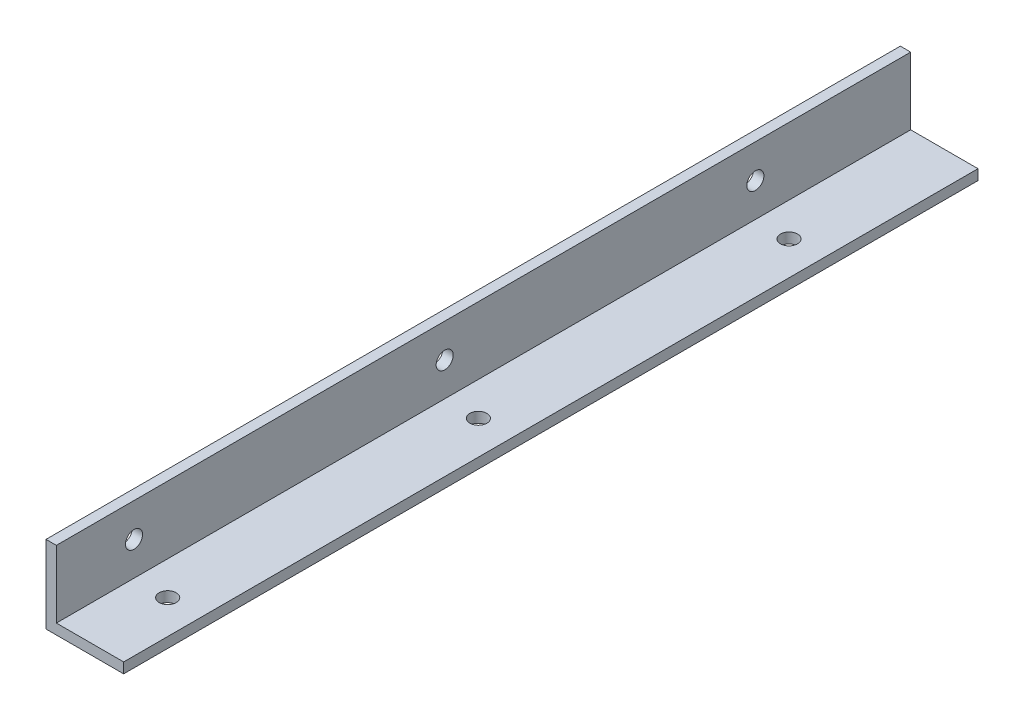
ISO-10303-21;
HEADER;
FILE_DESCRIPTION(('STEP AP214'),'2;1');
FILE_NAME('part.step','',(''),(''),'','','');
FILE_SCHEMA(('AUTOMOTIVE_DESIGN { 1 0 10303 214 1 1 1 1 }'));
ENDSEC;
DATA;
#1=APPLICATION_CONTEXT('core data for automotive mechanical design processes');
#2=APPLICATION_PROTOCOL_DEFINITION('international standard','automotive_design',2000,#1);
#3=PRODUCT_CONTEXT('',#1,'mechanical');
#4=PRODUCT('Part','Part','',(#3));
#5=PRODUCT_RELATED_PRODUCT_CATEGORY('part','',(#4));
#6=PRODUCT_DEFINITION_FORMATION('','',#4);
#7=PRODUCT_DEFINITION_CONTEXT('part definition',#1,'design');
#8=PRODUCT_DEFINITION('design','',#6,#7);
#9=PRODUCT_DEFINITION_SHAPE('','',#8);
#10=(LENGTH_UNIT() NAMED_UNIT(*) SI_UNIT(.MILLI.,.METRE.));
#11=(NAMED_UNIT(*) PLANE_ANGLE_UNIT() SI_UNIT($,.RADIAN.));
#12=(NAMED_UNIT(*) SI_UNIT($,.STERADIAN.) SOLID_ANGLE_UNIT());
#13=UNCERTAINTY_MEASURE_WITH_UNIT(LENGTH_MEASURE(1.E-05),#10,'distance_accuracy_value','');
#14=(GEOMETRIC_REPRESENTATION_CONTEXT(3) GLOBAL_UNCERTAINTY_ASSIGNED_CONTEXT((#13)) GLOBAL_UNIT_ASSIGNED_CONTEXT((#10,
#11,#12)) REPRESENTATION_CONTEXT('',''));
#15=CARTESIAN_POINT('',(0.,0.,0.));
#16=DIRECTION('',(0.,0.,1.));
#17=DIRECTION('',(1.,0.,0.));
#18=AXIS2_PLACEMENT_3D('',#15,#16,#17);
#19=CARTESIAN_POINT('',(15.,0.,150.));
#20=DIRECTION('',(0.,1.,0.));
#21=DIRECTION('',(-1.,0.,0.));
#22=AXIS2_PLACEMENT_3D('',#19,#20,#21);
#23=PLANE('',#22);
#24=CARTESIAN_POINT('',(8.50000000000002,0.,15.));
#25=DIRECTION('',(0.,1.,0.));
#26=DIRECTION('',(-1.,0.,0.));
#27=AXIS2_PLACEMENT_3D('',#24,#25,#26);
#28=CIRCLE('',#27,1.64999999999999);
#29=CARTESIAN_POINT('',(6.85000000000003,0.,15.));
#30=VERTEX_POINT('',#29);
#31=EDGE_CURVE('E38',#30,#30,#28,.T.);
#32=ORIENTED_EDGE('',*,*,#31,.T.);
#33=EDGE_LOOP('',(#32));
#34=FACE_BOUND('',#33,.T.);
#35=CARTESIAN_POINT('',(8.50000000000002,0.,75.));
#36=DIRECTION('',(0.,1.,0.));
#37=DIRECTION('',(-1.,0.,0.));
#38=AXIS2_PLACEMENT_3D('',#35,#36,#37);
#39=CIRCLE('',#38,1.64999999999999);
#40=CARTESIAN_POINT('',(6.85000000000003,0.,75.));
#41=VERTEX_POINT('',#40);
#42=EDGE_CURVE('E204',#41,#41,#39,.T.);
#43=ORIENTED_EDGE('',*,*,#42,.T.);
#44=EDGE_LOOP('',(#43));
#45=FACE_BOUND('',#44,.T.);
#46=CARTESIAN_POINT('',(8.50000000000002,0.,135.));
#47=DIRECTION('',(0.,1.,0.));
#48=DIRECTION('',(-1.,0.,0.));
#49=AXIS2_PLACEMENT_3D('',#46,#47,#48);
#50=CIRCLE('',#49,1.64999999999999);
#51=CARTESIAN_POINT('',(6.85000000000003,0.,135.));
#52=VERTEX_POINT('',#51);
#53=EDGE_CURVE('E150',#52,#52,#50,.T.);
#54=ORIENTED_EDGE('',*,*,#53,.T.);
#55=EDGE_LOOP('',(#54));
#56=FACE_BOUND('',#55,.T.);
#57=DIRECTION('',(0.,0.,-1.));
#58=VECTOR('',#57,1.);
#59=CARTESIAN_POINT('',(0.,0.,150.));
#60=LINE('',#59,#58);
#61=CARTESIAN_POINT('',(0.,0.,150.));
#62=VERTEX_POINT('',#61);
#63=CARTESIAN_POINT('',(0.,0.,-15.));
#64=VERTEX_POINT('',#63);
#65=EDGE_CURVE('E98',#62,#64,#60,.T.);
#66=ORIENTED_EDGE('',*,*,#65,.T.);
#67=DIRECTION('',(-1.,0.,0.));
#68=VECTOR('',#67,1.);
#69=CARTESIAN_POINT('',(0.,0.,-15.));
#70=LINE('',#69,#68);
#71=CARTESIAN_POINT('',(15.,0.,-15.));
#72=VERTEX_POINT('',#71);
#73=EDGE_CURVE('E97',#72,#64,#70,.T.);
#74=ORIENTED_EDGE('',*,*,#73,.F.);
#75=DIRECTION('',(0.,0.,-1.));
#76=VECTOR('',#75,1.);
#77=CARTESIAN_POINT('',(15.,0.,150.));
#78=LINE('',#77,#76);
#79=CARTESIAN_POINT('',(15.,0.,150.));
#80=VERTEX_POINT('',#79);
#81=EDGE_CURVE('E11',#80,#72,#78,.T.);
#82=ORIENTED_EDGE('',*,*,#81,.F.);
#83=DIRECTION('',(1.,0.,0.));
#84=VECTOR('',#83,1.);
#85=CARTESIAN_POINT('',(15.,0.,150.));
#86=LINE('',#85,#84);
#87=EDGE_CURVE('E124',#62,#80,#86,.T.);
#88=ORIENTED_EDGE('',*,*,#87,.F.);
#89=EDGE_LOOP('',(#66,#74,#82,#88));
#90=FACE_BOUND('',#89,.T.);
#91=ADVANCED_FACE('F35',(#34,#45,#56,#90),#23,.F.);
#92=CARTESIAN_POINT('',(15.,2.,150.));
#93=DIRECTION('',(-1.,0.,0.));
#94=DIRECTION('',(0.,0.,1.));
#95=AXIS2_PLACEMENT_3D('',#92,#93,#94);
#96=PLANE('',#95);
#97=ORIENTED_EDGE('',*,*,#81,.T.);
#98=DIRECTION('',(0.,-1.,0.));
#99=VECTOR('',#98,1.);
#100=CARTESIAN_POINT('',(15.,0.,-15.));
#101=LINE('',#100,#99);
#102=CARTESIAN_POINT('',(15.,2.,-15.));
#103=VERTEX_POINT('',#102);
#104=EDGE_CURVE('E92',#103,#72,#101,.T.);
#105=ORIENTED_EDGE('',*,*,#104,.F.);
#106=DIRECTION('',(0.,0.,-1.));
#107=VECTOR('',#106,1.);
#108=CARTESIAN_POINT('',(15.,2.,150.));
#109=LINE('',#108,#107);
#110=CARTESIAN_POINT('',(15.,2.,150.));
#111=VERTEX_POINT('',#110);
#112=EDGE_CURVE('E43',#111,#103,#109,.T.);
#113=ORIENTED_EDGE('',*,*,#112,.F.);
#114=DIRECTION('',(0.,1.,0.));
#115=VECTOR('',#114,1.);
#116=CARTESIAN_POINT('',(15.,2.,150.));
#117=LINE('',#116,#115);
#118=EDGE_CURVE('E93',#80,#111,#117,.T.);
#119=ORIENTED_EDGE('',*,*,#118,.F.);
#120=EDGE_LOOP('',(#97,#105,#113,#119));
#121=FACE_BOUND('',#120,.T.);
#122=ADVANCED_FACE('F89',(#121),#96,.F.);
#123=CARTESIAN_POINT('',(2.,2.,150.));
#124=DIRECTION('',(0.,-1.,0.));
#125=DIRECTION('',(0.,0.,-1.));
#126=AXIS2_PLACEMENT_3D('',#123,#124,#125);
#127=PLANE('',#126);
#128=CARTESIAN_POINT('',(8.50000000000002,2.,15.));
#129=DIRECTION('',(0.,1.,0.));
#130=DIRECTION('',(0.,0.,1.));
#131=AXIS2_PLACEMENT_3D('',#128,#129,#130);
#132=CIRCLE('',#131,1.64999999999999);
#133=CARTESIAN_POINT('',(8.50000000000002,2.,16.65));
#134=VERTEX_POINT('',#133);
#135=EDGE_CURVE('E347',#134,#134,#132,.T.);
#136=ORIENTED_EDGE('',*,*,#135,.F.);
#137=EDGE_LOOP('',(#136));
#138=FACE_BOUND('',#137,.T.);
#139=CARTESIAN_POINT('',(8.50000000000002,2.,75.));
#140=DIRECTION('',(0.,1.,0.));
#141=DIRECTION('',(0.,0.,1.));
#142=AXIS2_PLACEMENT_3D('',#139,#140,#141);
#143=CIRCLE('',#142,1.64999999999999);
#144=CARTESIAN_POINT('',(8.50000000000002,2.,76.65));
#145=VERTEX_POINT('',#144);
#146=EDGE_CURVE('E351',#145,#145,#143,.T.);
#147=ORIENTED_EDGE('',*,*,#146,.F.);
#148=EDGE_LOOP('',(#147));
#149=FACE_BOUND('',#148,.T.);
#150=CARTESIAN_POINT('',(8.50000000000002,2.,135.));
#151=DIRECTION('',(0.,1.,0.));
#152=DIRECTION('',(0.,0.,1.));
#153=AXIS2_PLACEMENT_3D('',#150,#151,#152);
#154=CIRCLE('',#153,1.64999999999999);
#155=CARTESIAN_POINT('',(8.50000000000002,2.,136.65));
#156=VERTEX_POINT('',#155);
#157=EDGE_CURVE('E155',#156,#156,#154,.T.);
#158=ORIENTED_EDGE('',*,*,#157,.F.);
#159=EDGE_LOOP('',(#158));
#160=FACE_BOUND('',#159,.T.);
#161=ORIENTED_EDGE('',*,*,#112,.T.);
#162=DIRECTION('',(1.,0.,0.));
#163=VECTOR('',#162,1.);
#164=CARTESIAN_POINT('',(15.,2.,-15.));
#165=LINE('',#164,#163);
#166=CARTESIAN_POINT('',(2.,2.,-15.));
#167=VERTEX_POINT('',#166);
#168=EDGE_CURVE('E108',#167,#103,#165,.T.);
#169=ORIENTED_EDGE('',*,*,#168,.F.);
#170=DIRECTION('',(0.,0.,-1.));
#171=VECTOR('',#170,1.);
#172=CARTESIAN_POINT('',(2.,2.,150.));
#173=LINE('',#172,#171);
#174=CARTESIAN_POINT('',(2.,2.,150.));
#175=VERTEX_POINT('',#174);
#176=EDGE_CURVE('E138',#175,#167,#173,.T.);
#177=ORIENTED_EDGE('',*,*,#176,.F.);
#178=DIRECTION('',(-1.,0.,0.));
#179=VECTOR('',#178,1.);
#180=CARTESIAN_POINT('',(2.,2.,150.));
#181=LINE('',#180,#179);
#182=EDGE_CURVE('E127',#111,#175,#181,.T.);
#183=ORIENTED_EDGE('',*,*,#182,.F.);
#184=EDGE_LOOP('',(#161,#169,#177,#183));
#185=FACE_BOUND('',#184,.T.);
#186=ADVANCED_FACE('F171',(#138,#149,#160,#185),#127,.F.);
#187=CARTESIAN_POINT('',(2.,15.,150.));
#188=DIRECTION('',(-1.,0.,0.));
#189=DIRECTION('',(0.,-1.,0.));
#190=AXIS2_PLACEMENT_3D('',#187,#188,#189);
#191=PLANE('',#190);
#192=CARTESIAN_POINT('',(2.,8.49999999999998,135.));
#193=DIRECTION('',(1.,0.,0.));
#194=DIRECTION('',(0.,0.,-1.));
#195=AXIS2_PLACEMENT_3D('',#192,#193,#194);
#196=CIRCLE('',#195,1.64999999999999);
#197=CARTESIAN_POINT('',(2.,8.49999999999998,133.35));
#198=VERTEX_POINT('',#197);
#199=EDGE_CURVE('E143',#198,#198,#196,.T.);
#200=ORIENTED_EDGE('',*,*,#199,.F.);
#201=EDGE_LOOP('',(#200));
#202=FACE_BOUND('',#201,.T.);
#203=CARTESIAN_POINT('',(2.,8.49999999999998,75.));
#204=DIRECTION('',(1.,0.,0.));
#205=DIRECTION('',(0.,0.,-1.));
#206=AXIS2_PLACEMENT_3D('',#203,#204,#205);
#207=CIRCLE('',#206,1.64999999999999);
#208=CARTESIAN_POINT('',(2.,8.49999999999998,73.35));
#209=VERTEX_POINT('',#208);
#210=EDGE_CURVE('E142',#209,#209,#207,.T.);
#211=ORIENTED_EDGE('',*,*,#210,.F.);
#212=EDGE_LOOP('',(#211));
#213=FACE_BOUND('',#212,.T.);
#214=CARTESIAN_POINT('',(2.,8.49999999999998,15.));
#215=DIRECTION('',(1.,0.,0.));
#216=DIRECTION('',(0.,0.,-1.));
#217=AXIS2_PLACEMENT_3D('',#214,#215,#216);
#218=CIRCLE('',#217,1.64999999999999);
#219=CARTESIAN_POINT('',(2.,8.49999999999998,13.35));
#220=VERTEX_POINT('',#219);
#221=EDGE_CURVE('E112',#220,#220,#218,.T.);
#222=ORIENTED_EDGE('',*,*,#221,.F.);
#223=EDGE_LOOP('',(#222));
#224=FACE_BOUND('',#223,.T.);
#225=ORIENTED_EDGE('',*,*,#176,.T.);
#226=DIRECTION('',(0.,-1.,0.));
#227=VECTOR('',#226,1.);
#228=CARTESIAN_POINT('',(2.,2.,-15.));
#229=LINE('',#228,#227);
#230=CARTESIAN_POINT('',(2.,15.,-15.));
#231=VERTEX_POINT('',#230);
#232=EDGE_CURVE('E121',#231,#167,#229,.T.);
#233=ORIENTED_EDGE('',*,*,#232,.F.);
#234=DIRECTION('',(0.,0.,-1.));
#235=VECTOR('',#234,1.);
#236=CARTESIAN_POINT('',(2.,15.,150.));
#237=LINE('',#236,#235);
#238=CARTESIAN_POINT('',(2.,15.,150.));
#239=VERTEX_POINT('',#238);
#240=EDGE_CURVE('E136',#239,#231,#237,.T.);
#241=ORIENTED_EDGE('',*,*,#240,.F.);
#242=DIRECTION('',(0.,1.,0.));
#243=VECTOR('',#242,1.);
#244=CARTESIAN_POINT('',(2.,15.,150.));
#245=LINE('',#244,#243);
#246=EDGE_CURVE('E129',#175,#239,#245,.T.);
#247=ORIENTED_EDGE('',*,*,#246,.F.);
#248=EDGE_LOOP('',(#225,#233,#241,#247));
#249=FACE_BOUND('',#248,.T.);
#250=ADVANCED_FACE('F167',(#202,#213,#224,#249),#191,.F.);
#251=CARTESIAN_POINT('',(0.,15.,150.));
#252=DIRECTION('',(0.,-1.,0.));
#253=DIRECTION('',(0.,0.,-1.));
#254=AXIS2_PLACEMENT_3D('',#251,#252,#253);
#255=PLANE('',#254);
#256=ORIENTED_EDGE('',*,*,#240,.T.);
#257=DIRECTION('',(1.,0.,0.));
#258=VECTOR('',#257,1.);
#259=CARTESIAN_POINT('',(2.,15.,-15.));
#260=LINE('',#259,#258);
#261=CARTESIAN_POINT('',(0.,15.,-15.));
#262=VERTEX_POINT('',#261);
#263=EDGE_CURVE('E118',#262,#231,#260,.T.);
#264=ORIENTED_EDGE('',*,*,#263,.F.);
#265=DIRECTION('',(0.,0.,-1.));
#266=VECTOR('',#265,1.);
#267=CARTESIAN_POINT('',(0.,15.,150.));
#268=LINE('',#267,#266);
#269=CARTESIAN_POINT('',(0.,15.,150.));
#270=VERTEX_POINT('',#269);
#271=EDGE_CURVE('E134',#270,#262,#268,.T.);
#272=ORIENTED_EDGE('',*,*,#271,.F.);
#273=DIRECTION('',(-1.,0.,0.));
#274=VECTOR('',#273,1.);
#275=CARTESIAN_POINT('',(0.,15.,150.));
#276=LINE('',#275,#274);
#277=EDGE_CURVE('E56',#239,#270,#276,.T.);
#278=ORIENTED_EDGE('',*,*,#277,.F.);
#279=EDGE_LOOP('',(#256,#264,#272,#278));
#280=FACE_BOUND('',#279,.T.);
#281=ADVANCED_FACE('F170',(#280),#255,.F.);
#282=CARTESIAN_POINT('',(0.,0.,150.));
#283=DIRECTION('',(1.,0.,0.));
#284=DIRECTION('',(0.,0.,-1.));
#285=AXIS2_PLACEMENT_3D('',#282,#283,#284);
#286=PLANE('',#285);
#287=CARTESIAN_POINT('',(0.,8.49999999999998,135.));
#288=DIRECTION('',(1.,0.,0.));
#289=DIRECTION('',(0.,0.,-1.));
#290=AXIS2_PLACEMENT_3D('',#287,#288,#289);
#291=CIRCLE('',#290,1.64999999999999);
#292=CARTESIAN_POINT('',(0.,8.49999999999998,133.35));
#293=VERTEX_POINT('',#292);
#294=EDGE_CURVE('E140',#293,#293,#291,.T.);
#295=ORIENTED_EDGE('',*,*,#294,.T.);
#296=EDGE_LOOP('',(#295));
#297=FACE_BOUND('',#296,.T.);
#298=CARTESIAN_POINT('',(0.,8.49999999999998,75.));
#299=DIRECTION('',(1.,0.,0.));
#300=DIRECTION('',(0.,0.,-1.));
#301=AXIS2_PLACEMENT_3D('',#298,#299,#300);
#302=CIRCLE('',#301,1.64999999999999);
#303=CARTESIAN_POINT('',(0.,8.49999999999998,73.35));
#304=VERTEX_POINT('',#303);
#305=EDGE_CURVE('E147',#304,#304,#302,.T.);
#306=ORIENTED_EDGE('',*,*,#305,.T.);
#307=EDGE_LOOP('',(#306));
#308=FACE_BOUND('',#307,.T.);
#309=CARTESIAN_POINT('',(0.,8.49999999999998,15.));
#310=DIRECTION('',(1.,0.,0.));
#311=DIRECTION('',(0.,0.,-1.));
#312=AXIS2_PLACEMENT_3D('',#309,#310,#311);
#313=CIRCLE('',#312,1.64999999999999);
#314=CARTESIAN_POINT('',(0.,8.49999999999998,13.35));
#315=VERTEX_POINT('',#314);
#316=EDGE_CURVE('E109',#315,#315,#313,.T.);
#317=ORIENTED_EDGE('',*,*,#316,.T.);
#318=EDGE_LOOP('',(#317));
#319=FACE_BOUND('',#318,.T.);
#320=ORIENTED_EDGE('',*,*,#271,.T.);
#321=DIRECTION('',(0.,1.,0.));
#322=VECTOR('',#321,1.);
#323=CARTESIAN_POINT('',(0.,15.,-15.));
#324=LINE('',#323,#322);
#325=EDGE_CURVE('E102',#64,#262,#324,.T.);
#326=ORIENTED_EDGE('',*,*,#325,.F.);
#327=ORIENTED_EDGE('',*,*,#65,.F.);
#328=DIRECTION('',(0.,-1.,0.));
#329=VECTOR('',#328,1.);
#330=CARTESIAN_POINT('',(0.,0.,150.));
#331=LINE('',#330,#329);
#332=EDGE_CURVE('E51',#270,#62,#331,.T.);
#333=ORIENTED_EDGE('',*,*,#332,.F.);
#334=EDGE_LOOP('',(#320,#326,#327,#333));
#335=FACE_BOUND('',#334,.T.);
#336=ADVANCED_FACE('F184',(#297,#308,#319,#335),#286,.F.);
#337=CARTESIAN_POINT('',(0.,0.,150.));
#338=DIRECTION('',(0.,0.,-1.));
#339=DIRECTION('',(-1.,0.,0.));
#340=AXIS2_PLACEMENT_3D('',#337,#338,#339);
#341=PLANE('',#340);
#342=ORIENTED_EDGE('',*,*,#87,.T.);
#343=ORIENTED_EDGE('',*,*,#118,.T.);
#344=ORIENTED_EDGE('',*,*,#182,.T.);
#345=ORIENTED_EDGE('',*,*,#246,.T.);
#346=ORIENTED_EDGE('',*,*,#277,.T.);
#347=ORIENTED_EDGE('',*,*,#332,.T.);
#348=EDGE_LOOP('',(#342,#343,#344,#345,#346,#347));
#349=FACE_BOUND('',#348,.T.);
#350=ADVANCED_FACE('F181',(#349),#341,.F.);
#351=CARTESIAN_POINT('',(0.,0.,-15.));
#352=DIRECTION('',(0.,0.,1.));
#353=DIRECTION('',(1.,0.,0.));
#354=AXIS2_PLACEMENT_3D('',#351,#352,#353);
#355=PLANE('',#354);
#356=ORIENTED_EDGE('',*,*,#104,.T.);
#357=ORIENTED_EDGE('',*,*,#73,.T.);
#358=ORIENTED_EDGE('',*,*,#325,.T.);
#359=ORIENTED_EDGE('',*,*,#263,.T.);
#360=ORIENTED_EDGE('',*,*,#232,.T.);
#361=ORIENTED_EDGE('',*,*,#168,.T.);
#362=EDGE_LOOP('',(#356,#357,#358,#359,#360,#361));
#363=FACE_BOUND('',#362,.T.);
#364=ADVANCED_FACE('F105',(#363),#355,.F.);
#365=CARTESIAN_POINT('',(2.,8.49999999999998,15.));
#366=DIRECTION('',(1.,0.,0.));
#367=DIRECTION('',(0.,0.,-1.));
#368=AXIS2_PLACEMENT_3D('',#365,#366,#367);
#369=CYLINDRICAL_SURFACE('',#368,1.64999999999999);
#370=ORIENTED_EDGE('',*,*,#221,.T.);
#371=EDGE_LOOP('',(#370));
#372=FACE_BOUND('',#371,.T.);
#373=ORIENTED_EDGE('',*,*,#316,.F.);
#374=EDGE_LOOP('',(#373));
#375=FACE_BOUND('',#374,.T.);
#376=ADVANCED_FACE('F164',(#372,#375),#369,.F.);
#377=CARTESIAN_POINT('',(2.,8.49999999999998,75.));
#378=DIRECTION('',(1.,0.,0.));
#379=DIRECTION('',(0.,0.,-1.));
#380=AXIS2_PLACEMENT_3D('',#377,#378,#379);
#381=CYLINDRICAL_SURFACE('',#380,1.64999999999999);
#382=ORIENTED_EDGE('',*,*,#210,.T.);
#383=EDGE_LOOP('',(#382));
#384=FACE_BOUND('',#383,.T.);
#385=ORIENTED_EDGE('',*,*,#305,.F.);
#386=EDGE_LOOP('',(#385));
#387=FACE_BOUND('',#386,.T.);
#388=ADVANCED_FACE('F220',(#384,#387),#381,.F.);
#389=CARTESIAN_POINT('',(2.,8.49999999999998,135.));
#390=DIRECTION('',(1.,0.,0.));
#391=DIRECTION('',(0.,0.,-1.));
#392=AXIS2_PLACEMENT_3D('',#389,#390,#391);
#393=CYLINDRICAL_SURFACE('',#392,1.64999999999999);
#394=ORIENTED_EDGE('',*,*,#199,.T.);
#395=EDGE_LOOP('',(#394));
#396=FACE_BOUND('',#395,.T.);
#397=ORIENTED_EDGE('',*,*,#294,.F.);
#398=EDGE_LOOP('',(#397));
#399=FACE_BOUND('',#398,.T.);
#400=ADVANCED_FACE('F210',(#396,#399),#393,.F.);
#401=CARTESIAN_POINT('',(8.50000000000002,2.,135.));
#402=DIRECTION('',(0.,1.,0.));
#403=DIRECTION('',(0.,0.,1.));
#404=AXIS2_PLACEMENT_3D('',#401,#402,#403);
#405=CYLINDRICAL_SURFACE('',#404,1.64999999999999);
#406=ORIENTED_EDGE('',*,*,#157,.T.);
#407=EDGE_LOOP('',(#406));
#408=FACE_BOUND('',#407,.T.);
#409=ORIENTED_EDGE('',*,*,#53,.F.);
#410=EDGE_LOOP('',(#409));
#411=FACE_BOUND('',#410,.T.);
#412=ADVANCED_FACE('F207',(#408,#411),#405,.F.);
#413=CARTESIAN_POINT('',(8.50000000000002,2.,75.));
#414=DIRECTION('',(0.,1.,0.));
#415=DIRECTION('',(0.,0.,1.));
#416=AXIS2_PLACEMENT_3D('',#413,#414,#415);
#417=CYLINDRICAL_SURFACE('',#416,1.64999999999999);
#418=ORIENTED_EDGE('',*,*,#146,.T.);
#419=EDGE_LOOP('',(#418));
#420=FACE_BOUND('',#419,.T.);
#421=ORIENTED_EDGE('',*,*,#42,.F.);
#422=EDGE_LOOP('',(#421));
#423=FACE_BOUND('',#422,.T.);
#424=ADVANCED_FACE('F209',(#420,#423),#417,.F.);
#425=CARTESIAN_POINT('',(8.50000000000002,2.,15.));
#426=DIRECTION('',(0.,1.,0.));
#427=DIRECTION('',(0.,0.,1.));
#428=AXIS2_PLACEMENT_3D('',#425,#426,#427);
#429=CYLINDRICAL_SURFACE('',#428,1.64999999999999);
#430=ORIENTED_EDGE('',*,*,#135,.T.);
#431=EDGE_LOOP('',(#430));
#432=FACE_BOUND('',#431,.T.);
#433=ORIENTED_EDGE('',*,*,#31,.F.);
#434=EDGE_LOOP('',(#433));
#435=FACE_BOUND('',#434,.T.);
#436=ADVANCED_FACE('F217',(#432,#435),#429,.F.);
#437=CLOSED_SHELL('',(#91,#122,#186,#250,#281,#336,#350,#364,#376,#388,#400,#412,#424,#436));
#438=MANIFOLD_SOLID_BREP('B2',#437);
#439=ADVANCED_BREP_SHAPE_REPRESENTATION('',(#18,#438),#14);
#440=SHAPE_DEFINITION_REPRESENTATION(#9,#439);
ENDSEC;
END-ISO-10303-21;
